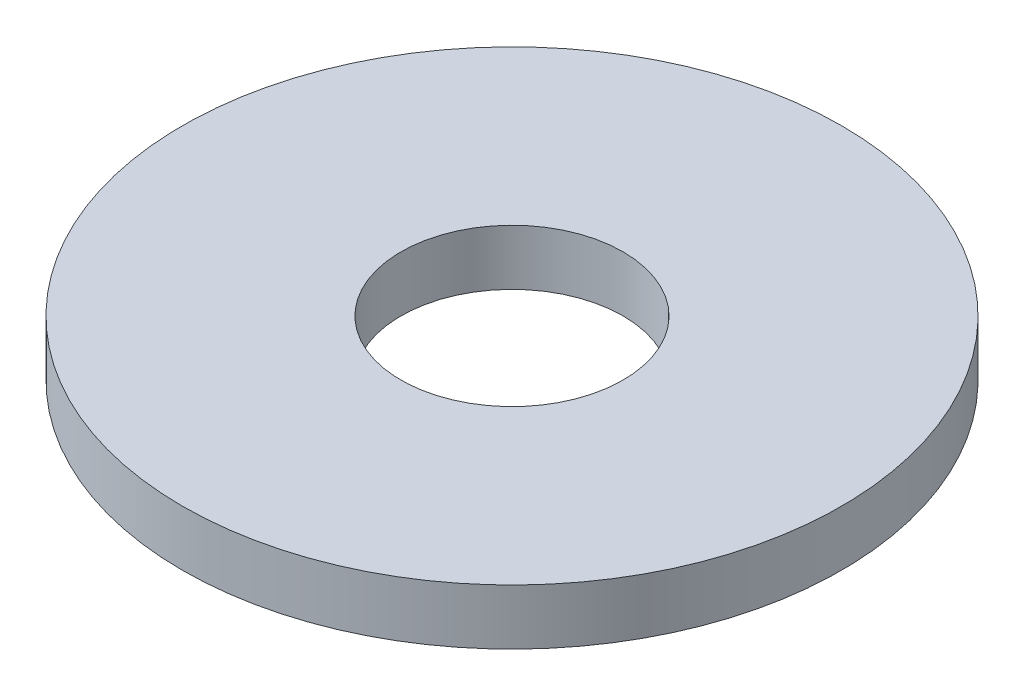
ISO-10303-21;
HEADER;
FILE_DESCRIPTION(('STEP AP214'),'2;1');
FILE_NAME('part.step','',(''),(''),'','','');
FILE_SCHEMA(('AUTOMOTIVE_DESIGN { 1 0 10303 214 1 1 1 1 }'));
ENDSEC;
DATA;
#1=APPLICATION_CONTEXT('core data for automotive mechanical design processes');
#2=APPLICATION_PROTOCOL_DEFINITION('international standard','automotive_design',2000,#1);
#3=PRODUCT_CONTEXT('',#1,'mechanical');
#4=PRODUCT('Part','Part','',(#3));
#5=PRODUCT_RELATED_PRODUCT_CATEGORY('part','',(#4));
#6=PRODUCT_DEFINITION_FORMATION('','',#4);
#7=PRODUCT_DEFINITION_CONTEXT('part definition',#1,'design');
#8=PRODUCT_DEFINITION('design','',#6,#7);
#9=PRODUCT_DEFINITION_SHAPE('','',#8);
#10=(LENGTH_UNIT() NAMED_UNIT(*) SI_UNIT(.MILLI.,.METRE.));
#11=(NAMED_UNIT(*) PLANE_ANGLE_UNIT() SI_UNIT($,.RADIAN.));
#12=(NAMED_UNIT(*) SI_UNIT($,.STERADIAN.) SOLID_ANGLE_UNIT());
#13=UNCERTAINTY_MEASURE_WITH_UNIT(LENGTH_MEASURE(1.E-05),#10,'distance_accuracy_value','');
#14=(GEOMETRIC_REPRESENTATION_CONTEXT(3) GLOBAL_UNCERTAINTY_ASSIGNED_CONTEXT((#13)) GLOBAL_UNIT_ASSIGNED_CONTEXT((#10,
#11,#12)) REPRESENTATION_CONTEXT('',''));
#15=CARTESIAN_POINT('',(0.,0.,0.));
#16=DIRECTION('',(0.,0.,1.));
#17=DIRECTION('',(1.,0.,0.));
#18=AXIS2_PLACEMENT_3D('',#15,#16,#17);
#19=CARTESIAN_POINT('',(0.,0.,0.));
#20=DIRECTION('',(0.,-1.,0.));
#21=DIRECTION('',(0.,0.,-1.));
#22=AXIS2_PLACEMENT_3D('',#19,#20,#21);
#23=CYLINDRICAL_SURFACE('',#22,6.);
#24=CARTESIAN_POINT('',(0.,3.,0.));
#25=DIRECTION('',(0.,-1.,0.));
#26=DIRECTION('',(0.,0.,-1.));
#27=AXIS2_PLACEMENT_3D('',#24,#25,#26);
#28=CIRCLE('',#27,6.);
#29=CARTESIAN_POINT('',(0.,3.,-6.));
#30=VERTEX_POINT('',#29);
#31=EDGE_CURVE('E10',#30,#30,#28,.T.);
#32=ORIENTED_EDGE('',*,*,#31,.F.);
#33=EDGE_LOOP('',(#32));
#34=FACE_BOUND('',#33,.T.);
#35=CARTESIAN_POINT('',(0.,0.,0.));
#36=DIRECTION('',(0.,-1.,0.));
#37=DIRECTION('',(0.,0.,-1.));
#38=AXIS2_PLACEMENT_3D('',#35,#36,#37);
#39=CIRCLE('',#38,6.);
#40=CARTESIAN_POINT('',(0.,0.,-6.));
#41=VERTEX_POINT('',#40);
#42=EDGE_CURVE('E46',#41,#41,#39,.T.);
#43=ORIENTED_EDGE('',*,*,#42,.T.);
#44=EDGE_LOOP('',(#43));
#45=FACE_BOUND('',#44,.T.);
#46=ADVANCED_FACE('F32',(#34,#45),#23,.F.);
#47=CARTESIAN_POINT('',(0.,3.,6.));
#48=DIRECTION('',(0.,-1.,0.));
#49=DIRECTION('',(0.,0.,-1.));
#50=AXIS2_PLACEMENT_3D('',#47,#48,#49);
#51=PLANE('',#50);
#52=CARTESIAN_POINT('',(0.,3.,0.));
#53=DIRECTION('',(0.,-1.,0.));
#54=DIRECTION('',(0.,0.,-1.));
#55=AXIS2_PLACEMENT_3D('',#52,#53,#54);
#56=CIRCLE('',#55,17.8);
#57=CARTESIAN_POINT('',(0.,3.,-17.8));
#58=VERTEX_POINT('',#57);
#59=EDGE_CURVE('E38',#58,#58,#56,.T.);
#60=ORIENTED_EDGE('',*,*,#59,.F.);
#61=EDGE_LOOP('',(#60));
#62=FACE_BOUND('',#61,.T.);
#63=ORIENTED_EDGE('',*,*,#31,.T.);
#64=EDGE_LOOP('',(#63));
#65=FACE_BOUND('',#64,.T.);
#66=ADVANCED_FACE('F61',(#62,#65),#51,.F.);
#67=CARTESIAN_POINT('',(0.,0.,0.));
#68=DIRECTION('',(0.,-1.,0.));
#69=DIRECTION('',(0.,0.,-1.));
#70=AXIS2_PLACEMENT_3D('',#67,#68,#69);
#71=CYLINDRICAL_SURFACE('',#70,17.8);
#72=CARTESIAN_POINT('',(0.,0.,0.));
#73=DIRECTION('',(0.,-1.,0.));
#74=DIRECTION('',(0.,0.,-1.));
#75=AXIS2_PLACEMENT_3D('',#72,#73,#74);
#76=CIRCLE('',#75,17.8);
#77=CARTESIAN_POINT('',(0.,0.,-17.8));
#78=VERTEX_POINT('',#77);
#79=EDGE_CURVE('E42',#78,#78,#76,.T.);
#80=ORIENTED_EDGE('',*,*,#79,.F.);
#81=EDGE_LOOP('',(#80));
#82=FACE_BOUND('',#81,.T.);
#83=ORIENTED_EDGE('',*,*,#59,.T.);
#84=EDGE_LOOP('',(#83));
#85=FACE_BOUND('',#84,.T.);
#86=ADVANCED_FACE('F56',(#82,#85),#71,.T.);
#87=CARTESIAN_POINT('',(0.,0.,6.));
#88=DIRECTION('',(0.,1.,0.));
#89=DIRECTION('',(0.,0.,1.));
#90=AXIS2_PLACEMENT_3D('',#87,#88,#89);
#91=PLANE('',#90);
#92=ORIENTED_EDGE('',*,*,#42,.F.);
#93=EDGE_LOOP('',(#92));
#94=FACE_BOUND('',#93,.T.);
#95=ORIENTED_EDGE('',*,*,#79,.T.);
#96=EDGE_LOOP('',(#95));
#97=FACE_BOUND('',#96,.T.);
#98=ADVANCED_FACE('F53',(#94,#97),#91,.F.);
#99=CLOSED_SHELL('',(#46,#66,#86,#98));
#100=MANIFOLD_SOLID_BREP('B2',#99);
#101=ADVANCED_BREP_SHAPE_REPRESENTATION('',(#18,#100),#14);
#102=SHAPE_DEFINITION_REPRESENTATION(#9,#101);
ENDSEC;
END-ISO-10303-21;
